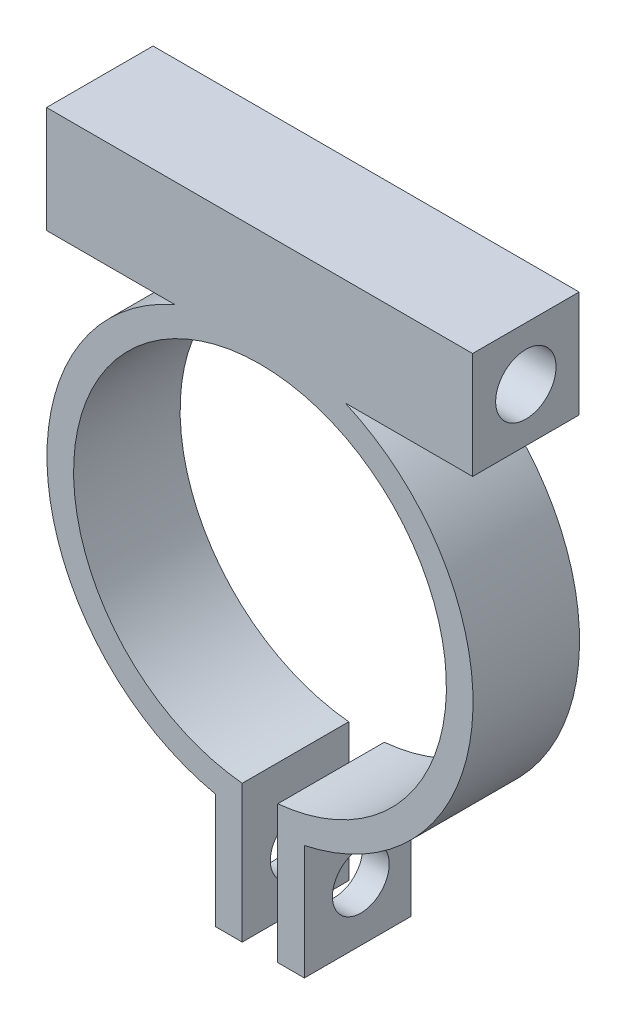
ISO-10303-21;
HEADER;
FILE_DESCRIPTION(('STEP AP214'),'2;1');
FILE_NAME('part.step','',(''),(''),'','','');
FILE_SCHEMA(('AUTOMOTIVE_DESIGN { 1 0 10303 214 1 1 1 1 }'));
ENDSEC;
DATA;
#1=APPLICATION_CONTEXT('core data for automotive mechanical design processes');
#2=APPLICATION_PROTOCOL_DEFINITION('international standard','automotive_design',2000,#1);
#3=PRODUCT_CONTEXT('',#1,'mechanical');
#4=PRODUCT('Part','Part','',(#3));
#5=PRODUCT_RELATED_PRODUCT_CATEGORY('part','',(#4));
#6=PRODUCT_DEFINITION_FORMATION('','',#4);
#7=PRODUCT_DEFINITION_CONTEXT('part definition',#1,'design');
#8=PRODUCT_DEFINITION('design','',#6,#7);
#9=PRODUCT_DEFINITION_SHAPE('','',#8);
#10=(LENGTH_UNIT() NAMED_UNIT(*) SI_UNIT(.MILLI.,.METRE.));
#11=(NAMED_UNIT(*) PLANE_ANGLE_UNIT() SI_UNIT($,.RADIAN.));
#12=(NAMED_UNIT(*) SI_UNIT($,.STERADIAN.) SOLID_ANGLE_UNIT());
#13=UNCERTAINTY_MEASURE_WITH_UNIT(LENGTH_MEASURE(1.E-05),#10,'distance_accuracy_value','');
#14=(GEOMETRIC_REPRESENTATION_CONTEXT(3) GLOBAL_UNCERTAINTY_ASSIGNED_CONTEXT((#13)) GLOBAL_UNIT_ASSIGNED_CONTEXT((#10,
#11,#12)) REPRESENTATION_CONTEXT('',''));
#15=CARTESIAN_POINT('',(0.,0.,0.));
#16=DIRECTION('',(0.,0.,1.));
#17=DIRECTION('',(1.,0.,0.));
#18=AXIS2_PLACEMENT_3D('',#15,#16,#17);
#19=CARTESIAN_POINT('',(0.,11.,6.));
#20=DIRECTION('',(0.,-1.,0.));
#21=DIRECTION('',(1.,0.,0.));
#22=AXIS2_PLACEMENT_3D('',#19,#20,#21);
#23=PLANE('',#22);
#24=DIRECTION('',(-1.,0.,0.));
#25=VECTOR('',#24,1.);
#26=CARTESIAN_POINT('',(0.,11.,0.));
#27=LINE('',#26,#25);
#28=CARTESIAN_POINT('',(11.975508884289,11.,0.));
#29=VERTEX_POINT('',#28);
#30=CARTESIAN_POINT('',(4.79583152331272,11.,0.));
#31=VERTEX_POINT('',#30);
#32=EDGE_CURVE('E315',#29,#31,#27,.T.);
#33=ORIENTED_EDGE('',*,*,#32,.F.);
#34=DIRECTION('',(0.,0.,-1.));
#35=VECTOR('',#34,1.);
#36=CARTESIAN_POINT('',(11.975508884289,11.,6.));
#37=LINE('',#36,#35);
#38=CARTESIAN_POINT('',(11.975508884289,11.,6.));
#39=VERTEX_POINT('',#38);
#40=EDGE_CURVE('E152',#39,#29,#37,.T.);
#41=ORIENTED_EDGE('',*,*,#40,.F.);
#42=DIRECTION('',(-1.,0.,0.));
#43=VECTOR('',#42,1.);
#44=CARTESIAN_POINT('',(0.,11.,6.));
#45=LINE('',#44,#43);
#46=CARTESIAN_POINT('',(4.79583152331272,11.,6.));
#47=VERTEX_POINT('',#46);
#48=EDGE_CURVE('E284',#39,#47,#45,.T.);
#49=ORIENTED_EDGE('',*,*,#48,.T.);
#50=DIRECTION('',(0.,0.,-1.));
#51=VECTOR('',#50,1.);
#52=CARTESIAN_POINT('',(4.79583152331272,11.,6.));
#53=LINE('',#52,#51);
#54=EDGE_CURVE('E12',#47,#31,#53,.T.);
#55=ORIENTED_EDGE('',*,*,#54,.T.);
#56=EDGE_LOOP('',(#33,#41,#49,#55));
#57=FACE_BOUND('',#56,.T.);
#58=ADVANCED_FACE('F142',(#57),#23,.T.);
#59=CARTESIAN_POINT('',(11.975508884289,0.,6.));
#60=DIRECTION('',(1.,0.,0.));
#61=DIRECTION('',(0.,0.,-1.));
#62=AXIS2_PLACEMENT_3D('',#59,#60,#61);
#63=PLANE('',#62);
#64=CARTESIAN_POINT('',(11.975508884289,14.,3.));
#65=DIRECTION('',(1.,0.,0.));
#66=DIRECTION('',(0.,0.,-1.));
#67=AXIS2_PLACEMENT_3D('',#64,#65,#66);
#68=CIRCLE('',#67,1.7);
#69=CARTESIAN_POINT('',(11.975508884289,14.,1.3));
#70=VERTEX_POINT('',#69);
#71=EDGE_CURVE('E251',#70,#70,#68,.T.);
#72=ORIENTED_EDGE('',*,*,#71,.F.);
#73=EDGE_LOOP('',(#72));
#74=FACE_BOUND('',#73,.T.);
#75=DIRECTION('',(0.,-1.,0.));
#76=VECTOR('',#75,1.);
#77=CARTESIAN_POINT('',(11.975508884289,0.,0.));
#78=LINE('',#77,#76);
#79=CARTESIAN_POINT('',(11.975508884289,17.,0.));
#80=VERTEX_POINT('',#79);
#81=EDGE_CURVE('E319',#80,#29,#78,.T.);
#82=ORIENTED_EDGE('',*,*,#81,.F.);
#83=DIRECTION('',(0.,0.,-1.));
#84=VECTOR('',#83,1.);
#85=CARTESIAN_POINT('',(11.975508884289,17.,6.));
#86=LINE('',#85,#84);
#87=CARTESIAN_POINT('',(11.975508884289,17.,6.));
#88=VERTEX_POINT('',#87);
#89=EDGE_CURVE('E345',#88,#80,#86,.T.);
#90=ORIENTED_EDGE('',*,*,#89,.F.);
#91=DIRECTION('',(0.,-1.,0.));
#92=VECTOR('',#91,1.);
#93=CARTESIAN_POINT('',(11.975508884289,0.,6.));
#94=LINE('',#93,#92);
#95=EDGE_CURVE('E287',#88,#39,#94,.T.);
#96=ORIENTED_EDGE('',*,*,#95,.T.);
#97=ORIENTED_EDGE('',*,*,#40,.T.);
#98=EDGE_LOOP('',(#82,#90,#96,#97));
#99=FACE_BOUND('',#98,.T.);
#100=ADVANCED_FACE('F379',(#74,#99),#63,.T.);
#101=CARTESIAN_POINT('',(0.,17.,6.));
#102=DIRECTION('',(0.,-1.,0.));
#103=DIRECTION('',(1.,0.,0.));
#104=AXIS2_PLACEMENT_3D('',#101,#102,#103);
#105=PLANE('',#104);
#106=DIRECTION('',(-1.,0.,0.));
#107=VECTOR('',#106,1.);
#108=CARTESIAN_POINT('',(0.,17.,0.));
#109=LINE('',#108,#107);
#110=CARTESIAN_POINT('',(-12.024491115711,17.,0.));
#111=VERTEX_POINT('',#110);
#112=EDGE_CURVE('E323',#80,#111,#109,.T.);
#113=ORIENTED_EDGE('',*,*,#112,.T.);
#114=DIRECTION('',(0.,0.,-1.));
#115=VECTOR('',#114,1.);
#116=CARTESIAN_POINT('',(-12.024491115711,17.,6.));
#117=LINE('',#116,#115);
#118=CARTESIAN_POINT('',(-12.024491115711,17.,6.));
#119=VERTEX_POINT('',#118);
#120=EDGE_CURVE('E342',#119,#111,#117,.T.);
#121=ORIENTED_EDGE('',*,*,#120,.F.);
#122=DIRECTION('',(-1.,0.,0.));
#123=VECTOR('',#122,1.);
#124=CARTESIAN_POINT('',(0.,17.,6.));
#125=LINE('',#124,#123);
#126=EDGE_CURVE('E303',#88,#119,#125,.T.);
#127=ORIENTED_EDGE('',*,*,#126,.F.);
#128=ORIENTED_EDGE('',*,*,#89,.T.);
#129=EDGE_LOOP('',(#113,#121,#127,#128));
#130=FACE_BOUND('',#129,.T.);
#131=ADVANCED_FACE('F384',(#130),#105,.F.);
#132=CARTESIAN_POINT('',(-12.024491115711,0.,6.));
#133=DIRECTION('',(1.,0.,0.));
#134=DIRECTION('',(0.,0.,-1.));
#135=AXIS2_PLACEMENT_3D('',#132,#133,#134);
#136=PLANE('',#135);
#137=CARTESIAN_POINT('',(-12.024491115711,14.,3.));
#138=DIRECTION('',(1.,0.,0.));
#139=DIRECTION('',(0.,0.,-1.));
#140=AXIS2_PLACEMENT_3D('',#137,#138,#139);
#141=CIRCLE('',#140,1.7);
#142=CARTESIAN_POINT('',(-12.024491115711,14.,1.3));
#143=VERTEX_POINT('',#142);
#144=EDGE_CURVE('E247',#143,#143,#141,.T.);
#145=ORIENTED_EDGE('',*,*,#144,.T.);
#146=EDGE_LOOP('',(#145));
#147=FACE_BOUND('',#146,.T.);
#148=DIRECTION('',(0.,-1.,0.));
#149=VECTOR('',#148,1.);
#150=CARTESIAN_POINT('',(-12.024491115711,0.,0.));
#151=LINE('',#150,#149);
#152=CARTESIAN_POINT('',(-12.024491115711,11.,0.));
#153=VERTEX_POINT('',#152);
#154=EDGE_CURVE('E325',#111,#153,#151,.T.);
#155=ORIENTED_EDGE('',*,*,#154,.T.);
#156=DIRECTION('',(0.,0.,-1.));
#157=VECTOR('',#156,1.);
#158=CARTESIAN_POINT('',(-12.024491115711,11.,6.));
#159=LINE('',#158,#157);
#160=CARTESIAN_POINT('',(-12.024491115711,11.,6.));
#161=VERTEX_POINT('',#160);
#162=EDGE_CURVE('E340',#161,#153,#159,.T.);
#163=ORIENTED_EDGE('',*,*,#162,.F.);
#164=DIRECTION('',(0.,-1.,0.));
#165=VECTOR('',#164,1.);
#166=CARTESIAN_POINT('',(-12.024491115711,0.,6.));
#167=LINE('',#166,#165);
#168=EDGE_CURVE('E298',#119,#161,#167,.T.);
#169=ORIENTED_EDGE('',*,*,#168,.F.);
#170=ORIENTED_EDGE('',*,*,#120,.T.);
#171=EDGE_LOOP('',(#155,#163,#169,#170));
#172=FACE_BOUND('',#171,.T.);
#173=ADVANCED_FACE('F388',(#147,#172),#136,.F.);
#174=CARTESIAN_POINT('',(-4.79583152331272,11.,0.));
#175=VERTEX_POINT('',#174);
#176=EDGE_CURVE('E320',#175,#153,#27,.T.);
#177=ORIENTED_EDGE('',*,*,#176,.F.);
#178=DIRECTION('',(0.,0.,-1.));
#179=VECTOR('',#178,1.);
#180=CARTESIAN_POINT('',(-4.79583152331272,11.,6.));
#181=LINE('',#180,#179);
#182=CARTESIAN_POINT('',(-4.79583152331272,11.,6.));
#183=VERTEX_POINT('',#182);
#184=EDGE_CURVE('E338',#183,#175,#181,.T.);
#185=ORIENTED_EDGE('',*,*,#184,.F.);
#186=EDGE_CURVE('E289',#183,#161,#45,.T.);
#187=ORIENTED_EDGE('',*,*,#186,.T.);
#188=ORIENTED_EDGE('',*,*,#162,.T.);
#189=EDGE_LOOP('',(#177,#185,#187,#188));
#190=FACE_BOUND('',#189,.T.);
#191=ADVANCED_FACE('F392',(#190),#23,.T.);
#192=CARTESIAN_POINT('',(0.,0.,6.));
#193=DIRECTION('',(0.,0.,-1.));
#194=DIRECTION('',(-1.,0.,0.));
#195=AXIS2_PLACEMENT_3D('',#192,#193,#194);
#196=CYLINDRICAL_SURFACE('',#195,12.);
#197=CARTESIAN_POINT('',(0.,0.,0.));
#198=DIRECTION('',(0.,0.,1.));
#199=DIRECTION('',(1.,0.,0.));
#200=AXIS2_PLACEMENT_3D('',#197,#198,#199);
#201=CIRCLE('',#200,12.);
#202=CARTESIAN_POINT('',(-2.5,-11.7366945943055,0.));
#203=VERTEX_POINT('',#202);
#204=EDGE_CURVE('E316',#175,#203,#201,.T.);
#205=ORIENTED_EDGE('',*,*,#204,.T.);
#206=DIRECTION('',(0.,0.,-1.));
#207=VECTOR('',#206,1.);
#208=CARTESIAN_POINT('',(-2.5,-11.7366945943055,6.));
#209=LINE('',#208,#207);
#210=CARTESIAN_POINT('',(-2.5,-11.7366945943055,6.));
#211=VERTEX_POINT('',#210);
#212=EDGE_CURVE('E336',#211,#203,#209,.T.);
#213=ORIENTED_EDGE('',*,*,#212,.F.);
#214=CARTESIAN_POINT('',(0.,0.,6.));
#215=DIRECTION('',(0.,0.,1.));
#216=DIRECTION('',(1.,0.,0.));
#217=AXIS2_PLACEMENT_3D('',#214,#215,#216);
#218=CIRCLE('',#217,12.);
#219=EDGE_CURVE('E286',#183,#211,#218,.T.);
#220=ORIENTED_EDGE('',*,*,#219,.F.);
#221=ORIENTED_EDGE('',*,*,#184,.T.);
#222=EDGE_LOOP('',(#205,#213,#220,#221));
#223=FACE_BOUND('',#222,.T.);
#224=ADVANCED_FACE('F396',(#223),#196,.T.);
#225=CARTESIAN_POINT('',(-0.999999999999999,0.,6.));
#226=DIRECTION('',(-1.,0.,0.));
#227=DIRECTION('',(0.,0.,1.));
#228=AXIS2_PLACEMENT_3D('',#225,#226,#227);
#229=PLANE('',#228);
#230=CARTESIAN_POINT('',(-0.999999999999999,-15.0238959065447,2.82053260266935));
#231=DIRECTION('',(-1.,0.,0.));
#232=DIRECTION('',(0.,0.,1.));
#233=AXIS2_PLACEMENT_3D('',#230,#231,#232);
#234=CIRCLE('',#233,1.6);
#235=CARTESIAN_POINT('',(-0.999999999999999,-15.0238959065447,4.42053260266934));
#236=VERTEX_POINT('',#235);
#237=EDGE_CURVE('E146',#236,#236,#234,.T.);
#238=ORIENTED_EDGE('',*,*,#237,.T.);
#239=EDGE_LOOP('',(#238));
#240=FACE_BOUND('',#239,.T.);
#241=DIRECTION('',(0.,1.,0.));
#242=VECTOR('',#241,1.);
#243=CARTESIAN_POINT('',(-0.999999999999999,0.,0.));
#244=LINE('',#243,#242);
#245=CARTESIAN_POINT('',(-0.999999999999998,-18.2018742401641,0.));
#246=VERTEX_POINT('',#245);
#247=CARTESIAN_POINT('',(-0.999999999999999,-10.4522724801834,0.));
#248=VERTEX_POINT('',#247);
#249=EDGE_CURVE('E328',#246,#248,#244,.T.);
#250=ORIENTED_EDGE('',*,*,#249,.T.);
#251=DIRECTION('',(0.,0.,-1.));
#252=VECTOR('',#251,1.);
#253=CARTESIAN_POINT('',(-0.999999999999999,-10.4522724801834,6.));
#254=LINE('',#253,#252);
#255=CARTESIAN_POINT('',(-0.999999999999999,-10.4522724801834,6.));
#256=VERTEX_POINT('',#255);
#257=EDGE_CURVE('E334',#256,#248,#254,.T.);
#258=ORIENTED_EDGE('',*,*,#257,.F.);
#259=DIRECTION('',(0.,1.,0.));
#260=VECTOR('',#259,1.);
#261=CARTESIAN_POINT('',(-0.999999999999999,0.,6.));
#262=LINE('',#261,#260);
#263=CARTESIAN_POINT('',(-0.999999999999998,-18.2018742401641,6.));
#264=VERTEX_POINT('',#263);
#265=EDGE_CURVE('E290',#264,#256,#262,.T.);
#266=ORIENTED_EDGE('',*,*,#265,.F.);
#267=DIRECTION('',(0.,0.,-1.));
#268=VECTOR('',#267,1.);
#269=CARTESIAN_POINT('',(-0.999999999999998,-18.2018742401641,6.));
#270=LINE('',#269,#268);
#271=EDGE_CURVE('E266',#264,#246,#270,.T.);
#272=ORIENTED_EDGE('',*,*,#271,.T.);
#273=EDGE_LOOP('',(#250,#258,#266,#272));
#274=FACE_BOUND('',#273,.T.);
#275=ADVANCED_FACE('F357',(#240,#274),#229,.F.);
#276=CARTESIAN_POINT('',(0.,0.,6.));
#277=DIRECTION('',(0.,0.,-1.));
#278=DIRECTION('',(-1.,0.,0.));
#279=AXIS2_PLACEMENT_3D('',#276,#277,#278);
#280=CYLINDRICAL_SURFACE('',#279,10.5);
#281=CARTESIAN_POINT('',(0.,0.,0.));
#282=DIRECTION('',(0.,0.,1.));
#283=DIRECTION('',(1.,0.,0.));
#284=AXIS2_PLACEMENT_3D('',#281,#282,#283);
#285=CIRCLE('',#284,10.5);
#286=CARTESIAN_POINT('',(1.,-10.4522724801834,0.));
#287=VERTEX_POINT('',#286);
#288=EDGE_CURVE('E234',#287,#248,#285,.T.);
#289=ORIENTED_EDGE('',*,*,#288,.F.);
#290=DIRECTION('',(0.,0.,-1.));
#291=VECTOR('',#290,1.);
#292=CARTESIAN_POINT('',(1.,-10.4522724801834,6.));
#293=LINE('',#292,#291);
#294=CARTESIAN_POINT('',(1.,-10.4522724801834,6.));
#295=VERTEX_POINT('',#294);
#296=EDGE_CURVE('E230',#295,#287,#293,.T.);
#297=ORIENTED_EDGE('',*,*,#296,.F.);
#298=CARTESIAN_POINT('',(0.,0.,6.));
#299=DIRECTION('',(0.,0.,1.));
#300=DIRECTION('',(1.,0.,0.));
#301=AXIS2_PLACEMENT_3D('',#298,#299,#300);
#302=CIRCLE('',#301,10.5);
#303=EDGE_CURVE('E295',#295,#256,#302,.T.);
#304=ORIENTED_EDGE('',*,*,#303,.T.);
#305=ORIENTED_EDGE('',*,*,#257,.T.);
#306=EDGE_LOOP('',(#289,#297,#304,#305));
#307=FACE_BOUND('',#306,.T.);
#308=ADVANCED_FACE('F403',(#307),#280,.F.);
#309=CARTESIAN_POINT('',(1.,0.,6.));
#310=DIRECTION('',(-1.,0.,0.));
#311=DIRECTION('',(0.,0.,1.));
#312=AXIS2_PLACEMENT_3D('',#309,#310,#311);
#313=PLANE('',#312);
#314=CARTESIAN_POINT('',(1.,-15.0238959065447,2.82053260266935));
#315=DIRECTION('',(-1.,0.,0.));
#316=DIRECTION('',(0.,0.,1.));
#317=AXIS2_PLACEMENT_3D('',#314,#315,#316);
#318=CIRCLE('',#317,1.6);
#319=CARTESIAN_POINT('',(1.,-15.0238959065447,4.42053260266934));
#320=VERTEX_POINT('',#319);
#321=EDGE_CURVE('E443',#320,#320,#318,.T.);
#322=ORIENTED_EDGE('',*,*,#321,.F.);
#323=EDGE_LOOP('',(#322));
#324=FACE_BOUND('',#323,.T.);
#325=DIRECTION('',(0.,1.,0.));
#326=VECTOR('',#325,1.);
#327=CARTESIAN_POINT('',(1.,0.,0.));
#328=LINE('',#327,#326);
#329=CARTESIAN_POINT('',(1.,-18.2018742401641,0.));
#330=VERTEX_POINT('',#329);
#331=EDGE_CURVE('E224',#330,#287,#328,.T.);
#332=ORIENTED_EDGE('',*,*,#331,.F.);
#333=DIRECTION('',(0.,0.,-1.));
#334=VECTOR('',#333,1.);
#335=CARTESIAN_POINT('',(1.,-18.2018742401641,6.));
#336=LINE('',#335,#334);
#337=CARTESIAN_POINT('',(1.,-18.2018742401641,6.));
#338=VERTEX_POINT('',#337);
#339=EDGE_CURVE('E228',#338,#330,#336,.T.);
#340=ORIENTED_EDGE('',*,*,#339,.F.);
#341=DIRECTION('',(0.,1.,0.));
#342=VECTOR('',#341,1.);
#343=CARTESIAN_POINT('',(1.,0.,6.));
#344=LINE('',#343,#342);
#345=EDGE_CURVE('E312',#338,#295,#344,.T.);
#346=ORIENTED_EDGE('',*,*,#345,.T.);
#347=ORIENTED_EDGE('',*,*,#296,.T.);
#348=EDGE_LOOP('',(#332,#340,#346,#347));
#349=FACE_BOUND('',#348,.T.);
#350=ADVANCED_FACE('F226',(#324,#349),#313,.T.);
#351=CARTESIAN_POINT('',(2.5,-11.7366945943055,0.));
#352=VERTEX_POINT('',#351);
#353=EDGE_CURVE('E269',#352,#31,#201,.T.);
#354=ORIENTED_EDGE('',*,*,#353,.T.);
#355=ORIENTED_EDGE('',*,*,#54,.F.);
#356=CARTESIAN_POINT('',(2.5,-11.7366945943055,6.));
#357=VERTEX_POINT('',#356);
#358=EDGE_CURVE('E233',#357,#47,#218,.T.);
#359=ORIENTED_EDGE('',*,*,#358,.F.);
#360=DIRECTION('',(0.,0.,-1.));
#361=VECTOR('',#360,1.);
#362=CARTESIAN_POINT('',(2.5,-11.7366945943055,6.));
#363=LINE('',#362,#361);
#364=EDGE_CURVE('E161',#357,#352,#363,.T.);
#365=ORIENTED_EDGE('',*,*,#364,.T.);
#366=EDGE_LOOP('',(#354,#355,#359,#365));
#367=FACE_BOUND('',#366,.T.);
#368=ADVANCED_FACE('F282',(#367),#196,.T.);
#369=CARTESIAN_POINT('',(0.,0.,0.));
#370=DIRECTION('',(0.,0.,1.));
#371=DIRECTION('',(1.,0.,0.));
#372=AXIS2_PLACEMENT_3D('',#369,#370,#371);
#373=PLANE('',#372);
#374=DIRECTION('',(0.,-1.,0.));
#375=VECTOR('',#374,1.);
#376=CARTESIAN_POINT('',(-2.5,-11.2018742401641,0.));
#377=LINE('',#376,#375);
#378=CARTESIAN_POINT('',(-2.5,-18.2018742401641,0.));
#379=VERTEX_POINT('',#378);
#380=EDGE_CURVE('E257',#203,#379,#377,.T.);
#381=ORIENTED_EDGE('',*,*,#380,.F.);
#382=ORIENTED_EDGE('',*,*,#204,.F.);
#383=ORIENTED_EDGE('',*,*,#176,.T.);
#384=ORIENTED_EDGE('',*,*,#154,.F.);
#385=ORIENTED_EDGE('',*,*,#112,.F.);
#386=ORIENTED_EDGE('',*,*,#81,.T.);
#387=ORIENTED_EDGE('',*,*,#32,.T.);
#388=ORIENTED_EDGE('',*,*,#353,.F.);
#389=DIRECTION('',(0.,-1.,0.));
#390=VECTOR('',#389,1.);
#391=CARTESIAN_POINT('',(2.5,-11.2018742401641,0.));
#392=LINE('',#391,#390);
#393=CARTESIAN_POINT('',(2.5,-18.2018742401641,0.));
#394=VERTEX_POINT('',#393);
#395=EDGE_CURVE('E218',#352,#394,#392,.T.);
#396=ORIENTED_EDGE('',*,*,#395,.T.);
#397=DIRECTION('',(1.,0.,0.));
#398=VECTOR('',#397,1.);
#399=CARTESIAN_POINT('',(1.,-18.2018742401641,0.));
#400=LINE('',#399,#398);
#401=EDGE_CURVE('E239',#330,#394,#400,.T.);
#402=ORIENTED_EDGE('',*,*,#401,.F.);
#403=ORIENTED_EDGE('',*,*,#331,.T.);
#404=ORIENTED_EDGE('',*,*,#288,.T.);
#405=ORIENTED_EDGE('',*,*,#249,.F.);
#406=DIRECTION('',(-1.,0.,0.));
#407=VECTOR('',#406,1.);
#408=CARTESIAN_POINT('',(-0.999999999999998,-18.2018742401641,0.));
#409=LINE('',#408,#407);
#410=EDGE_CURVE('E255',#246,#379,#409,.T.);
#411=ORIENTED_EDGE('',*,*,#410,.T.);
#412=EDGE_LOOP('',(#381,#382,#383,#384,#385,#386,#387,#388,#396,#402,#403,#404,#405,#411));
#413=FACE_BOUND('',#412,.T.);
#414=ADVANCED_FACE('F246',(#413),#373,.F.);
#415=CARTESIAN_POINT('',(0.,0.,6.));
#416=DIRECTION('',(0.,0.,1.));
#417=DIRECTION('',(1.,0.,0.));
#418=AXIS2_PLACEMENT_3D('',#415,#416,#417);
#419=PLANE('',#418);
#420=ORIENTED_EDGE('',*,*,#219,.T.);
#421=DIRECTION('',(0.,-1.,0.));
#422=VECTOR('',#421,1.);
#423=CARTESIAN_POINT('',(-2.5,-11.2018742401641,6.));
#424=LINE('',#423,#422);
#425=CARTESIAN_POINT('',(-2.5,-18.2018742401641,6.));
#426=VERTEX_POINT('',#425);
#427=EDGE_CURVE('E263',#211,#426,#424,.T.);
#428=ORIENTED_EDGE('',*,*,#427,.T.);
#429=DIRECTION('',(-1.,0.,0.));
#430=VECTOR('',#429,1.);
#431=CARTESIAN_POINT('',(-0.999999999999998,-18.2018742401641,6.));
#432=LINE('',#431,#430);
#433=EDGE_CURVE('E260',#264,#426,#432,.T.);
#434=ORIENTED_EDGE('',*,*,#433,.F.);
#435=ORIENTED_EDGE('',*,*,#265,.T.);
#436=ORIENTED_EDGE('',*,*,#303,.F.);
#437=ORIENTED_EDGE('',*,*,#345,.F.);
#438=DIRECTION('',(1.,0.,0.));
#439=VECTOR('',#438,1.);
#440=CARTESIAN_POINT('',(1.,-18.2018742401641,6.));
#441=LINE('',#440,#439);
#442=CARTESIAN_POINT('',(2.5,-18.2018742401641,6.));
#443=VERTEX_POINT('',#442);
#444=EDGE_CURVE('E241',#338,#443,#441,.T.);
#445=ORIENTED_EDGE('',*,*,#444,.T.);
#446=DIRECTION('',(0.,-1.,0.));
#447=VECTOR('',#446,1.);
#448=CARTESIAN_POINT('',(2.5,-11.2018742401641,6.));
#449=LINE('',#448,#447);
#450=EDGE_CURVE('E243',#357,#443,#449,.T.);
#451=ORIENTED_EDGE('',*,*,#450,.F.);
#452=ORIENTED_EDGE('',*,*,#358,.T.);
#453=ORIENTED_EDGE('',*,*,#48,.F.);
#454=ORIENTED_EDGE('',*,*,#95,.F.);
#455=ORIENTED_EDGE('',*,*,#126,.T.);
#456=ORIENTED_EDGE('',*,*,#168,.T.);
#457=ORIENTED_EDGE('',*,*,#186,.F.);
#458=EDGE_LOOP('',(#420,#428,#434,#435,#436,#437,#445,#451,#452,#453,#454,#455,#456,#457));
#459=FACE_BOUND('',#458,.T.);
#460=ADVANCED_FACE('F277',(#459),#419,.T.);
#461=CARTESIAN_POINT('',(2.5,-11.2018742401641,6.));
#462=DIRECTION('',(1.,0.,0.));
#463=DIRECTION('',(0.,1.,0.));
#464=AXIS2_PLACEMENT_3D('',#461,#462,#463);
#465=PLANE('',#464);
#466=CARTESIAN_POINT('',(2.5,-15.0238959065447,2.82053260266935));
#467=DIRECTION('',(1.,0.,0.));
#468=DIRECTION('',(0.,1.,0.));
#469=AXIS2_PLACEMENT_3D('',#466,#467,#468);
#470=CIRCLE('',#469,1.6);
#471=CARTESIAN_POINT('',(2.5,-13.4238959065447,2.82053260266935));
#472=VERTEX_POINT('',#471);
#473=EDGE_CURVE('E440',#472,#472,#470,.T.);
#474=ORIENTED_EDGE('',*,*,#473,.F.);
#475=EDGE_LOOP('',(#474));
#476=FACE_BOUND('',#475,.T.);
#477=ORIENTED_EDGE('',*,*,#364,.F.);
#478=ORIENTED_EDGE('',*,*,#450,.T.);
#479=DIRECTION('',(0.,0.,-1.));
#480=VECTOR('',#479,1.);
#481=CARTESIAN_POINT('',(2.5,-18.2018742401641,6.));
#482=LINE('',#481,#480);
#483=EDGE_CURVE('E242',#443,#394,#482,.T.);
#484=ORIENTED_EDGE('',*,*,#483,.T.);
#485=ORIENTED_EDGE('',*,*,#395,.F.);
#486=EDGE_LOOP('',(#477,#478,#484,#485));
#487=FACE_BOUND('',#486,.T.);
#488=ADVANCED_FACE('F273',(#476,#487),#465,.T.);
#489=CARTESIAN_POINT('',(1.,-18.2018742401641,6.));
#490=DIRECTION('',(0.,1.,0.));
#491=DIRECTION('',(0.,0.,1.));
#492=AXIS2_PLACEMENT_3D('',#489,#490,#491);
#493=PLANE('',#492);
#494=ORIENTED_EDGE('',*,*,#401,.T.);
#495=ORIENTED_EDGE('',*,*,#483,.F.);
#496=ORIENTED_EDGE('',*,*,#444,.F.);
#497=ORIENTED_EDGE('',*,*,#339,.T.);
#498=EDGE_LOOP('',(#494,#495,#496,#497));
#499=FACE_BOUND('',#498,.T.);
#500=ADVANCED_FACE('F144',(#499),#493,.F.);
#501=CARTESIAN_POINT('',(-2.5,-11.2018742401641,6.));
#502=DIRECTION('',(1.,0.,0.));
#503=DIRECTION('',(0.,1.,0.));
#504=AXIS2_PLACEMENT_3D('',#501,#502,#503);
#505=PLANE('',#504);
#506=CARTESIAN_POINT('',(-2.5,-15.0238959065447,2.82053260266935));
#507=DIRECTION('',(-1.,0.,0.));
#508=DIRECTION('',(0.,0.,1.));
#509=AXIS2_PLACEMENT_3D('',#506,#507,#508);
#510=CIRCLE('',#509,1.6);
#511=CARTESIAN_POINT('',(-2.5,-15.0238959065447,4.42053260266934));
#512=VERTEX_POINT('',#511);
#513=EDGE_CURVE('E448',#512,#512,#510,.T.);
#514=ORIENTED_EDGE('',*,*,#513,.F.);
#515=EDGE_LOOP('',(#514));
#516=FACE_BOUND('',#515,.T.);
#517=ORIENTED_EDGE('',*,*,#427,.F.);
#518=ORIENTED_EDGE('',*,*,#212,.T.);
#519=ORIENTED_EDGE('',*,*,#380,.T.);
#520=DIRECTION('',(0.,0.,-1.));
#521=VECTOR('',#520,1.);
#522=CARTESIAN_POINT('',(-2.5,-18.2018742401641,6.));
#523=LINE('',#522,#521);
#524=EDGE_CURVE('E270',#426,#379,#523,.T.);
#525=ORIENTED_EDGE('',*,*,#524,.F.);
#526=EDGE_LOOP('',(#517,#518,#519,#525));
#527=FACE_BOUND('',#526,.T.);
#528=ADVANCED_FACE('F354',(#516,#527),#505,.F.);
#529=CARTESIAN_POINT('',(-0.999999999999998,-18.2018742401641,6.));
#530=DIRECTION('',(0.,-1.,0.));
#531=DIRECTION('',(0.,0.,-1.));
#532=AXIS2_PLACEMENT_3D('',#529,#530,#531);
#533=PLANE('',#532);
#534=ORIENTED_EDGE('',*,*,#410,.F.);
#535=ORIENTED_EDGE('',*,*,#271,.F.);
#536=ORIENTED_EDGE('',*,*,#433,.T.);
#537=ORIENTED_EDGE('',*,*,#524,.T.);
#538=EDGE_LOOP('',(#534,#535,#536,#537));
#539=FACE_BOUND('',#538,.T.);
#540=ADVANCED_FACE('F355',(#539),#533,.T.);
#541=CARTESIAN_POINT('',(11.975508884289,14.,3.));
#542=DIRECTION('',(1.,0.,0.));
#543=DIRECTION('',(0.,0.,-1.));
#544=AXIS2_PLACEMENT_3D('',#541,#542,#543);
#545=CYLINDRICAL_SURFACE('',#544,1.7);
#546=ORIENTED_EDGE('',*,*,#144,.F.);
#547=EDGE_LOOP('',(#546));
#548=FACE_BOUND('',#547,.T.);
#549=ORIENTED_EDGE('',*,*,#71,.T.);
#550=EDGE_LOOP('',(#549));
#551=FACE_BOUND('',#550,.T.);
#552=ADVANCED_FACE('F419',(#548,#551),#545,.F.);
#553=CARTESIAN_POINT('',(-2.5,-15.0238959065447,2.82053260266935));
#554=DIRECTION('',(-1.,0.,0.));
#555=DIRECTION('',(0.,0.,1.));
#556=AXIS2_PLACEMENT_3D('',#553,#554,#555);
#557=CYLINDRICAL_SURFACE('',#556,1.6);
#558=ORIENTED_EDGE('',*,*,#513,.T.);
#559=EDGE_LOOP('',(#558));
#560=FACE_BOUND('',#559,.T.);
#561=ORIENTED_EDGE('',*,*,#237,.F.);
#562=EDGE_LOOP('',(#561));
#563=FACE_BOUND('',#562,.T.);
#564=ADVANCED_FACE('F436',(#560,#563),#557,.F.);
#565=ORIENTED_EDGE('',*,*,#473,.T.);
#566=EDGE_LOOP('',(#565));
#567=FACE_BOUND('',#566,.T.);
#568=ORIENTED_EDGE('',*,*,#321,.T.);
#569=EDGE_LOOP('',(#568));
#570=FACE_BOUND('',#569,.T.);
#571=ADVANCED_FACE('F456',(#567,#570),#557,.F.);
#572=CLOSED_SHELL('',(#58,#100,#131,#173,#191,#224,#275,#308,#350,#368,#414,#460,#488,#500,#528,
#540,#552,#564,#571));
#573=MANIFOLD_SOLID_BREP('B2',#572);
#574=ADVANCED_BREP_SHAPE_REPRESENTATION('',(#18,#573),#14);
#575=SHAPE_DEFINITION_REPRESENTATION(#9,#574);
ENDSEC;
END-ISO-10303-21;
